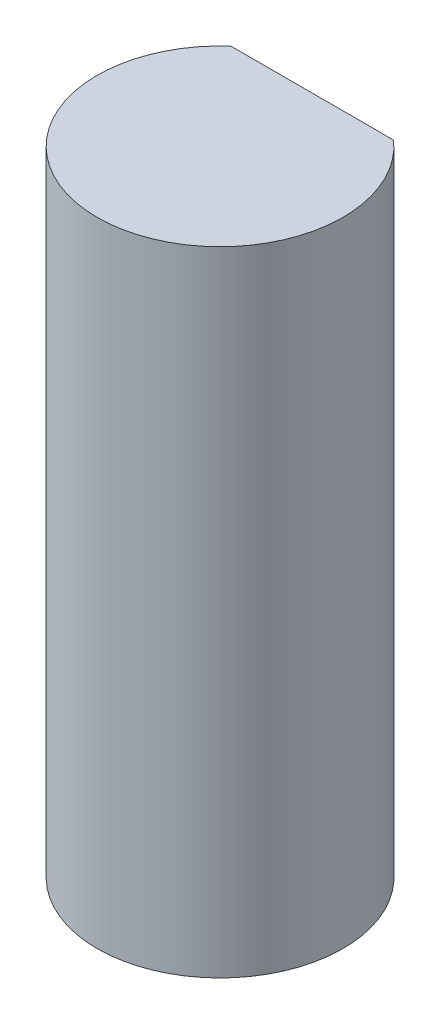
ISO-10303-21;
HEADER;
FILE_DESCRIPTION(('STEP AP214'),'2;1');
FILE_NAME('part.step','',(''),(''),'','','');
FILE_SCHEMA(('AUTOMOTIVE_DESIGN { 1 0 10303 214 1 1 1 1 }'));
ENDSEC;
DATA;
#1=APPLICATION_CONTEXT('core data for automotive mechanical design processes');
#2=APPLICATION_PROTOCOL_DEFINITION('international standard','automotive_design',2000,#1);
#3=PRODUCT_CONTEXT('',#1,'mechanical');
#4=PRODUCT('Part','Part','',(#3));
#5=PRODUCT_RELATED_PRODUCT_CATEGORY('part','',(#4));
#6=PRODUCT_DEFINITION_FORMATION('','',#4);
#7=PRODUCT_DEFINITION_CONTEXT('part definition',#1,'design');
#8=PRODUCT_DEFINITION('design','',#6,#7);
#9=PRODUCT_DEFINITION_SHAPE('','',#8);
#10=(LENGTH_UNIT() NAMED_UNIT(*) SI_UNIT(.MILLI.,.METRE.));
#11=(NAMED_UNIT(*) PLANE_ANGLE_UNIT() SI_UNIT($,.RADIAN.));
#12=(NAMED_UNIT(*) SI_UNIT($,.STERADIAN.) SOLID_ANGLE_UNIT());
#13=UNCERTAINTY_MEASURE_WITH_UNIT(LENGTH_MEASURE(1.E-05),#10,'distance_accuracy_value','');
#14=(GEOMETRIC_REPRESENTATION_CONTEXT(3) GLOBAL_UNCERTAINTY_ASSIGNED_CONTEXT((#13)) GLOBAL_UNIT_ASSIGNED_CONTEXT((#10,
#11,#12)) REPRESENTATION_CONTEXT('',''));
#15=CARTESIAN_POINT('',(0.,0.,0.));
#16=DIRECTION('',(0.,0.,1.));
#17=DIRECTION('',(1.,0.,0.));
#18=AXIS2_PLACEMENT_3D('',#15,#16,#17);
#19=CARTESIAN_POINT('',(0.,20.6,0.));
#20=DIRECTION('',(0.,-1.,0.));
#21=DIRECTION('',(0.,0.,-1.));
#22=AXIS2_PLACEMENT_3D('',#19,#20,#21);
#23=CYLINDRICAL_SURFACE('',#22,4.);
#24=CARTESIAN_POINT('',(0.,20.6,0.));
#25=DIRECTION('',(0.,1.,0.));
#26=DIRECTION('',(0.,0.,1.));
#27=AXIS2_PLACEMENT_3D('',#24,#25,#26);
#28=CIRCLE('',#27,4.);
#29=CARTESIAN_POINT('',(-2.64575131106459,20.6,-3.));
#30=VERTEX_POINT('',#29);
#31=CARTESIAN_POINT('',(2.64575131106459,20.6,-3.));
#32=VERTEX_POINT('',#31);
#33=EDGE_CURVE('E11',#30,#32,#28,.T.);
#34=ORIENTED_EDGE('',*,*,#33,.F.);
#35=DIRECTION('',(0.,1.,0.));
#36=VECTOR('',#35,1.);
#37=CARTESIAN_POINT('',(-2.64575131106459,10.6,-3.));
#38=LINE('',#37,#36);
#39=CARTESIAN_POINT('',(-2.64575131106459,10.6,-3.));
#40=VERTEX_POINT('',#39);
#41=EDGE_CURVE('E47',#40,#30,#38,.T.);
#42=ORIENTED_EDGE('',*,*,#41,.F.);
#43=CARTESIAN_POINT('',(0.,10.6,0.));
#44=DIRECTION('',(0.,1.,0.));
#45=DIRECTION('',(0.,0.,-1.));
#46=AXIS2_PLACEMENT_3D('',#43,#44,#45);
#47=CIRCLE('',#46,4.);
#48=CARTESIAN_POINT('',(2.64575131106459,10.6,-3.));
#49=VERTEX_POINT('',#48);
#50=EDGE_CURVE('E62',#49,#40,#47,.T.);
#51=ORIENTED_EDGE('',*,*,#50,.F.);
#52=DIRECTION('',(0.,1.,0.));
#53=VECTOR('',#52,1.);
#54=CARTESIAN_POINT('',(2.64575131106459,10.6,-3.));
#55=LINE('',#54,#53);
#56=EDGE_CURVE('E53',#49,#32,#55,.T.);
#57=ORIENTED_EDGE('',*,*,#56,.T.);
#58=EDGE_LOOP('',(#34,#42,#51,#57));
#59=FACE_BOUND('',#58,.T.);
#60=CARTESIAN_POINT('',(0.,0.,0.));
#61=DIRECTION('',(0.,1.,0.));
#62=DIRECTION('',(0.,0.,1.));
#63=AXIS2_PLACEMENT_3D('',#60,#61,#62);
#64=CIRCLE('',#63,4.);
#65=CARTESIAN_POINT('',(0.,0.,4.));
#66=VERTEX_POINT('',#65);
#67=EDGE_CURVE('E36',#66,#66,#64,.T.);
#68=ORIENTED_EDGE('',*,*,#67,.T.);
#69=EDGE_LOOP('',(#68));
#70=FACE_BOUND('',#69,.T.);
#71=ADVANCED_FACE('F33',(#59,#70),#23,.T.);
#72=CARTESIAN_POINT('',(0.,20.6,0.));
#73=DIRECTION('',(0.,1.,0.));
#74=DIRECTION('',(0.,0.,1.));
#75=AXIS2_PLACEMENT_3D('',#72,#73,#74);
#76=PLANE('',#75);
#77=DIRECTION('',(1.,0.,0.));
#78=VECTOR('',#77,1.);
#79=CARTESIAN_POINT('',(-2.64575131106459,20.6,-3.));
#80=LINE('',#79,#78);
#81=EDGE_CURVE('E58',#30,#32,#80,.T.);
#82=ORIENTED_EDGE('',*,*,#81,.F.);
#83=ORIENTED_EDGE('',*,*,#33,.T.);
#84=EDGE_LOOP('',(#82,#83));
#85=FACE_BOUND('',#84,.T.);
#86=ADVANCED_FACE('F68',(#85),#76,.T.);
#87=CARTESIAN_POINT('',(0.,0.,0.));
#88=DIRECTION('',(0.,1.,0.));
#89=DIRECTION('',(0.,0.,1.));
#90=AXIS2_PLACEMENT_3D('',#87,#88,#89);
#91=PLANE('',#90);
#92=ORIENTED_EDGE('',*,*,#67,.F.);
#93=EDGE_LOOP('',(#92));
#94=FACE_BOUND('',#93,.T.);
#95=ADVANCED_FACE('F70',(#94),#91,.F.);
#96=CARTESIAN_POINT('',(-2.64575131106459,10.6,-3.));
#97=DIRECTION('',(0.,0.,1.));
#98=DIRECTION('',(1.,0.,0.));
#99=AXIS2_PLACEMENT_3D('',#96,#97,#98);
#100=PLANE('',#99);
#101=ORIENTED_EDGE('',*,*,#81,.T.);
#102=ORIENTED_EDGE('',*,*,#56,.F.);
#103=DIRECTION('',(1.,0.,0.));
#104=VECTOR('',#103,1.);
#105=CARTESIAN_POINT('',(-2.64575131106459,10.6,-3.));
#106=LINE('',#105,#104);
#107=EDGE_CURVE('E85',#40,#49,#106,.T.);
#108=ORIENTED_EDGE('',*,*,#107,.F.);
#109=ORIENTED_EDGE('',*,*,#41,.T.);
#110=EDGE_LOOP('',(#101,#102,#108,#109));
#111=FACE_BOUND('',#110,.T.);
#112=ADVANCED_FACE('F59',(#111),#100,.F.);
#113=CARTESIAN_POINT('',(0.,10.6,0.));
#114=DIRECTION('',(0.,-1.,0.));
#115=DIRECTION('',(0.,0.,-1.));
#116=AXIS2_PLACEMENT_3D('',#113,#114,#115);
#117=PLANE('',#116);
#118=ORIENTED_EDGE('',*,*,#50,.T.);
#119=ORIENTED_EDGE('',*,*,#107,.T.);
#120=EDGE_LOOP('',(#118,#119));
#121=FACE_BOUND('',#120,.T.);
#122=ADVANCED_FACE('F80',(#121),#117,.F.);
#123=CLOSED_SHELL('',(#71,#86,#95,#112,#122));
#124=MANIFOLD_SOLID_BREP('B2',#123);
#125=ADVANCED_BREP_SHAPE_REPRESENTATION('',(#18,#124),#14);
#126=SHAPE_DEFINITION_REPRESENTATION(#9,#125);
ENDSEC;
END-ISO-10303-21;
